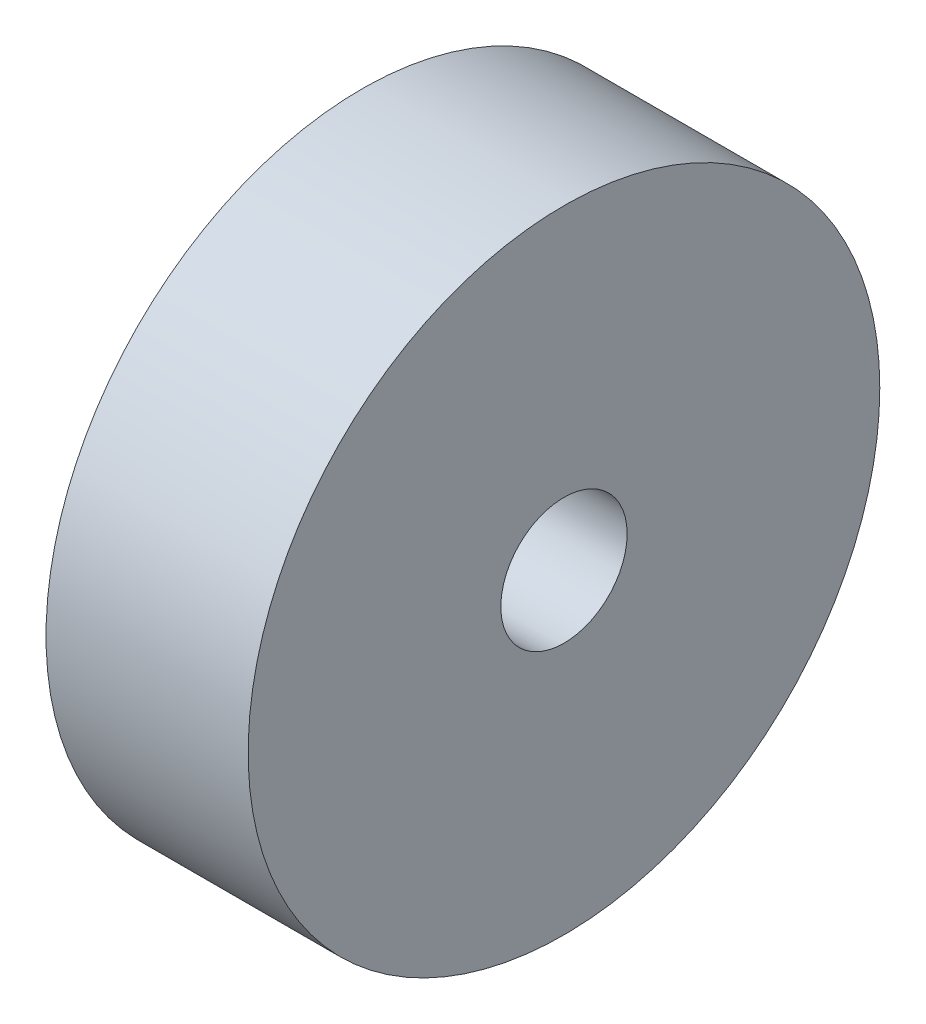
ISO-10303-21;
HEADER;
FILE_DESCRIPTION(('STEP AP214'),'2;1');
FILE_NAME('part.step','',(''),(''),'','','');
FILE_SCHEMA(('AUTOMOTIVE_DESIGN { 1 0 10303 214 1 1 1 1 }'));
ENDSEC;
DATA;
#1=APPLICATION_CONTEXT('core data for automotive mechanical design processes');
#2=APPLICATION_PROTOCOL_DEFINITION('international standard','automotive_design',2000,#1);
#3=PRODUCT_CONTEXT('',#1,'mechanical');
#4=PRODUCT('Part','Part','',(#3));
#5=PRODUCT_RELATED_PRODUCT_CATEGORY('part','',(#4));
#6=PRODUCT_DEFINITION_FORMATION('','',#4);
#7=PRODUCT_DEFINITION_CONTEXT('part definition',#1,'design');
#8=PRODUCT_DEFINITION('design','',#6,#7);
#9=PRODUCT_DEFINITION_SHAPE('','',#8);
#10=(LENGTH_UNIT() NAMED_UNIT(*) SI_UNIT(.MILLI.,.METRE.));
#11=(NAMED_UNIT(*) PLANE_ANGLE_UNIT() SI_UNIT($,.RADIAN.));
#12=(NAMED_UNIT(*) SI_UNIT($,.STERADIAN.) SOLID_ANGLE_UNIT());
#13=UNCERTAINTY_MEASURE_WITH_UNIT(LENGTH_MEASURE(1.E-05),#10,'distance_accuracy_value','');
#14=(GEOMETRIC_REPRESENTATION_CONTEXT(3) GLOBAL_UNCERTAINTY_ASSIGNED_CONTEXT((#13)) GLOBAL_UNIT_ASSIGNED_CONTEXT((#10,
#11,#12)) REPRESENTATION_CONTEXT('',''));
#15=CARTESIAN_POINT('',(0.,0.,0.));
#16=DIRECTION('',(0.,0.,1.));
#17=DIRECTION('',(1.,0.,0.));
#18=AXIS2_PLACEMENT_3D('',#15,#16,#17);
#19=CARTESIAN_POINT('',(8.,0.,0.));
#20=DIRECTION('',(1.,0.,0.));
#21=DIRECTION('',(0.,0.,-1.));
#22=AXIS2_PLACEMENT_3D('',#19,#20,#21);
#23=PLANE('',#22);
#24=CARTESIAN_POINT('',(8.,0.,0.));
#25=DIRECTION('',(1.,0.,0.));
#26=DIRECTION('',(0.,0.,-1.));
#27=AXIS2_PLACEMENT_3D('',#24,#25,#26);
#28=CIRCLE('',#27,12.5);
#29=CARTESIAN_POINT('',(8.,0.,-12.5));
#30=VERTEX_POINT('',#29);
#31=EDGE_CURVE('E10',#30,#30,#28,.T.);
#32=ORIENTED_EDGE('',*,*,#31,.T.);
#33=EDGE_LOOP('',(#32));
#34=FACE_BOUND('',#33,.T.);
#35=CARTESIAN_POINT('',(8.,0.,0.));
#36=DIRECTION('',(1.,0.,0.));
#37=DIRECTION('',(0.,0.,-1.));
#38=AXIS2_PLACEMENT_3D('',#35,#36,#37);
#39=CIRCLE('',#38,2.5);
#40=CARTESIAN_POINT('',(8.,0.,-2.5));
#41=VERTEX_POINT('',#40);
#42=EDGE_CURVE('E43',#41,#41,#39,.T.);
#43=ORIENTED_EDGE('',*,*,#42,.F.);
#44=EDGE_LOOP('',(#43));
#45=FACE_BOUND('',#44,.T.);
#46=ADVANCED_FACE('F32',(#34,#45),#23,.T.);
#47=CARTESIAN_POINT('',(0.,0.,0.));
#48=DIRECTION('',(1.,0.,0.));
#49=DIRECTION('',(0.,0.,-1.));
#50=AXIS2_PLACEMENT_3D('',#47,#48,#49);
#51=PLANE('',#50);
#52=CARTESIAN_POINT('',(0.,0.,0.));
#53=DIRECTION('',(1.,0.,0.));
#54=DIRECTION('',(0.,0.,-1.));
#55=AXIS2_PLACEMENT_3D('',#52,#53,#54);
#56=CIRCLE('',#55,12.5);
#57=CARTESIAN_POINT('',(0.,0.,-12.5));
#58=VERTEX_POINT('',#57);
#59=EDGE_CURVE('E36',#58,#58,#56,.T.);
#60=ORIENTED_EDGE('',*,*,#59,.F.);
#61=EDGE_LOOP('',(#60));
#62=FACE_BOUND('',#61,.T.);
#63=CARTESIAN_POINT('',(0.,0.,0.));
#64=DIRECTION('',(1.,0.,0.));
#65=DIRECTION('',(0.,0.,-1.));
#66=AXIS2_PLACEMENT_3D('',#63,#64,#65);
#67=CIRCLE('',#66,2.5);
#68=CARTESIAN_POINT('',(0.,0.,-2.5));
#69=VERTEX_POINT('',#68);
#70=EDGE_CURVE('E45',#69,#69,#67,.T.);
#71=ORIENTED_EDGE('',*,*,#70,.T.);
#72=EDGE_LOOP('',(#71));
#73=FACE_BOUND('',#72,.T.);
#74=ADVANCED_FACE('F55',(#62,#73),#51,.F.);
#75=CARTESIAN_POINT('',(8.,0.,0.));
#76=DIRECTION('',(-1.,0.,0.));
#77=DIRECTION('',(0.,0.,1.));
#78=AXIS2_PLACEMENT_3D('',#75,#76,#77);
#79=CYLINDRICAL_SURFACE('',#78,12.5);
#80=ORIENTED_EDGE('',*,*,#31,.F.);
#81=EDGE_LOOP('',(#80));
#82=FACE_BOUND('',#81,.T.);
#83=ORIENTED_EDGE('',*,*,#59,.T.);
#84=EDGE_LOOP('',(#83));
#85=FACE_BOUND('',#84,.T.);
#86=ADVANCED_FACE('F34',(#82,#85),#79,.T.);
#87=CARTESIAN_POINT('',(8.,0.,0.));
#88=DIRECTION('',(-1.,0.,0.));
#89=DIRECTION('',(0.,0.,1.));
#90=AXIS2_PLACEMENT_3D('',#87,#88,#89);
#91=CYLINDRICAL_SURFACE('',#90,2.5);
#92=ORIENTED_EDGE('',*,*,#42,.T.);
#93=EDGE_LOOP('',(#92));
#94=FACE_BOUND('',#93,.T.);
#95=ORIENTED_EDGE('',*,*,#70,.F.);
#96=EDGE_LOOP('',(#95));
#97=FACE_BOUND('',#96,.T.);
#98=ADVANCED_FACE('F51',(#94,#97),#91,.F.);
#99=CLOSED_SHELL('',(#46,#74,#86,#98));
#100=MANIFOLD_SOLID_BREP('B2',#99);
#101=ADVANCED_BREP_SHAPE_REPRESENTATION('',(#18,#100),#14);
#102=SHAPE_DEFINITION_REPRESENTATION(#9,#101);
ENDSEC;
END-ISO-10303-21;
